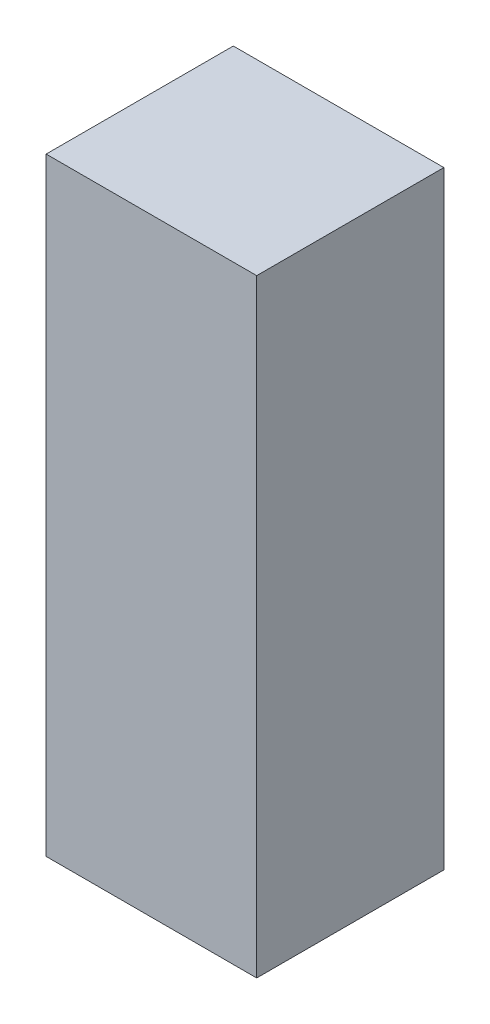
ISO-10303-21;
HEADER;
FILE_DESCRIPTION(('STEP AP214'),'2;1');
FILE_NAME('part.step','',(''),(''),'','','');
FILE_SCHEMA(('AUTOMOTIVE_DESIGN { 1 0 10303 214 1 1 1 1 }'));
ENDSEC;
DATA;
#1=APPLICATION_CONTEXT('core data for automotive mechanical design processes');
#2=APPLICATION_PROTOCOL_DEFINITION('international standard','automotive_design',2000,#1);
#3=PRODUCT_CONTEXT('',#1,'mechanical');
#4=PRODUCT('Part','Part','',(#3));
#5=PRODUCT_RELATED_PRODUCT_CATEGORY('part','',(#4));
#6=PRODUCT_DEFINITION_FORMATION('','',#4);
#7=PRODUCT_DEFINITION_CONTEXT('part definition',#1,'design');
#8=PRODUCT_DEFINITION('design','',#6,#7);
#9=PRODUCT_DEFINITION_SHAPE('','',#8);
#10=(LENGTH_UNIT() NAMED_UNIT(*) SI_UNIT(.MILLI.,.METRE.));
#11=(NAMED_UNIT(*) PLANE_ANGLE_UNIT() SI_UNIT($,.RADIAN.));
#12=(NAMED_UNIT(*) SI_UNIT($,.STERADIAN.) SOLID_ANGLE_UNIT());
#13=UNCERTAINTY_MEASURE_WITH_UNIT(LENGTH_MEASURE(1.E-05),#10,'distance_accuracy_value','');
#14=(GEOMETRIC_REPRESENTATION_CONTEXT(3) GLOBAL_UNCERTAINTY_ASSIGNED_CONTEXT((#13)) GLOBAL_UNIT_ASSIGNED_CONTEXT((#10,
#11,#12)) REPRESENTATION_CONTEXT('',''));
#15=CARTESIAN_POINT('',(0.,0.,0.));
#16=DIRECTION('',(0.,0.,1.));
#17=DIRECTION('',(1.,0.,0.));
#18=AXIS2_PLACEMENT_3D('',#15,#16,#17);
#19=CARTESIAN_POINT('',(0.22500082,0.65000124,0.4));
#20=DIRECTION('',(0.,0.,1.));
#21=DIRECTION('',(1.,0.,0.));
#22=AXIS2_PLACEMENT_3D('',#19,#20,#21);
#23=PLANE('',#22);
#24=DIRECTION('',(1.,0.,0.));
#25=VECTOR('',#24,1.);
#26=CARTESIAN_POINT('',(0.22500082,-0.6499987,0.4));
#27=LINE('',#26,#25);
#28=CARTESIAN_POINT('',(0.22500082,-0.6499987,0.4));
#29=VERTEX_POINT('',#28);
#30=CARTESIAN_POINT('',(-0.22499828,-0.6499987,0.4));
#31=VERTEX_POINT('',#30);
#32=EDGE_CURVE('E53',#29,#31,#27,.F.);
#33=ORIENTED_EDGE('',*,*,#32,.F.);
#34=DIRECTION('',(0.,1.,0.));
#35=VECTOR('',#34,1.);
#36=CARTESIAN_POINT('',(0.22500082,0.65000124,0.4));
#37=LINE('',#36,#35);
#38=CARTESIAN_POINT('',(0.22500082,0.65000124,0.4));
#39=VERTEX_POINT('',#38);
#40=EDGE_CURVE('E69',#39,#29,#37,.F.);
#41=ORIENTED_EDGE('',*,*,#40,.F.);
#42=DIRECTION('',(1.,0.,0.));
#43=VECTOR('',#42,1.);
#44=CARTESIAN_POINT('',(-0.22499828,0.65000124,0.4));
#45=LINE('',#44,#43);
#46=CARTESIAN_POINT('',(-0.22499828,0.65000124,0.4));
#47=VERTEX_POINT('',#46);
#48=EDGE_CURVE('E19',#47,#39,#45,.T.);
#49=ORIENTED_EDGE('',*,*,#48,.F.);
#50=DIRECTION('',(0.,1.,0.));
#51=VECTOR('',#50,1.);
#52=CARTESIAN_POINT('',(-0.22499828,-0.6499987,0.4));
#53=LINE('',#52,#51);
#54=EDGE_CURVE('E58',#31,#47,#53,.T.);
#55=ORIENTED_EDGE('',*,*,#54,.F.);
#56=EDGE_LOOP('',(#33,#41,#49,#55));
#57=FACE_BOUND('',#56,.T.);
#58=ADVANCED_FACE('F16',(#57),#23,.T.);
#59=CARTESIAN_POINT('',(-0.22499828,0.65000124,0.));
#60=DIRECTION('',(0.,1.,0.));
#61=DIRECTION('',(0.,0.,1.));
#62=AXIS2_PLACEMENT_3D('',#59,#60,#61);
#63=PLANE('',#62);
#64=DIRECTION('',(0.,0.,-1.));
#65=VECTOR('',#64,1.);
#66=CARTESIAN_POINT('',(0.22500082,0.65000124,0.));
#67=LINE('',#66,#65);
#68=CARTESIAN_POINT('',(0.22500082,0.65000124,0.));
#69=VERTEX_POINT('',#68);
#70=EDGE_CURVE('E88',#69,#39,#67,.F.);
#71=ORIENTED_EDGE('',*,*,#70,.F.);
#72=DIRECTION('',(1.,0.,0.));
#73=VECTOR('',#72,1.);
#74=CARTESIAN_POINT('',(0.22500082,0.65000124,0.));
#75=LINE('',#74,#73);
#76=CARTESIAN_POINT('',(-0.22499828,0.65000124,0.));
#77=VERTEX_POINT('',#76);
#78=EDGE_CURVE('E76',#69,#77,#75,.F.);
#79=ORIENTED_EDGE('',*,*,#78,.T.);
#80=DIRECTION('',(0.,0.,1.));
#81=VECTOR('',#80,1.);
#82=CARTESIAN_POINT('',(-0.22499828,0.65000124,0.));
#83=LINE('',#82,#81);
#84=EDGE_CURVE('E63',#47,#77,#83,.F.);
#85=ORIENTED_EDGE('',*,*,#84,.F.);
#86=ORIENTED_EDGE('',*,*,#48,.T.);
#87=EDGE_LOOP('',(#71,#79,#85,#86));
#88=FACE_BOUND('',#87,.T.);
#89=ADVANCED_FACE('F75',(#88),#63,.T.);
#90=CARTESIAN_POINT('',(-0.22499828,-0.6499987,0.));
#91=DIRECTION('',(-1.,0.,0.));
#92=DIRECTION('',(0.,0.,1.));
#93=AXIS2_PLACEMENT_3D('',#90,#91,#92);
#94=PLANE('',#93);
#95=ORIENTED_EDGE('',*,*,#84,.T.);
#96=DIRECTION('',(0.,1.,0.));
#97=VECTOR('',#96,1.);
#98=CARTESIAN_POINT('',(-0.22499828,0.65000124,0.));
#99=LINE('',#98,#97);
#100=CARTESIAN_POINT('',(-0.22499828,-0.6499987,0.));
#101=VERTEX_POINT('',#100);
#102=EDGE_CURVE('E96',#77,#101,#99,.F.);
#103=ORIENTED_EDGE('',*,*,#102,.T.);
#104=DIRECTION('',(0.,0.,-1.));
#105=VECTOR('',#104,1.);
#106=CARTESIAN_POINT('',(-0.22499828,-0.6499987,0.));
#107=LINE('',#106,#105);
#108=EDGE_CURVE('E65',#31,#101,#107,.T.);
#109=ORIENTED_EDGE('',*,*,#108,.F.);
#110=ORIENTED_EDGE('',*,*,#54,.T.);
#111=EDGE_LOOP('',(#95,#103,#109,#110));
#112=FACE_BOUND('',#111,.T.);
#113=ADVANCED_FACE('F60',(#112),#94,.T.);
#114=CARTESIAN_POINT('',(0.22500082,-0.6499987,0.));
#115=DIRECTION('',(0.,-1.,0.));
#116=DIRECTION('',(0.,0.,-1.));
#117=AXIS2_PLACEMENT_3D('',#114,#115,#116);
#118=PLANE('',#117);
#119=ORIENTED_EDGE('',*,*,#108,.T.);
#120=DIRECTION('',(1.,0.,0.));
#121=VECTOR('',#120,1.);
#122=CARTESIAN_POINT('',(0.22500082,-0.6499987,0.));
#123=LINE('',#122,#121);
#124=CARTESIAN_POINT('',(0.22500082,-0.6499987,0.));
#125=VERTEX_POINT('',#124);
#126=EDGE_CURVE('E26',#101,#125,#123,.T.);
#127=ORIENTED_EDGE('',*,*,#126,.T.);
#128=DIRECTION('',(0.,0.,-1.));
#129=VECTOR('',#128,1.);
#130=CARTESIAN_POINT('',(0.22500082,-0.6499987,0.));
#131=LINE('',#130,#129);
#132=EDGE_CURVE('E34',#29,#125,#131,.T.);
#133=ORIENTED_EDGE('',*,*,#132,.F.);
#134=ORIENTED_EDGE('',*,*,#32,.T.);
#135=EDGE_LOOP('',(#119,#127,#133,#134));
#136=FACE_BOUND('',#135,.T.);
#137=ADVANCED_FACE('F102',(#136),#118,.T.);
#138=CARTESIAN_POINT('',(0.22500082,0.65000124,0.));
#139=DIRECTION('',(1.,0.,0.));
#140=DIRECTION('',(0.,0.,-1.));
#141=AXIS2_PLACEMENT_3D('',#138,#139,#140);
#142=PLANE('',#141);
#143=ORIENTED_EDGE('',*,*,#132,.T.);
#144=DIRECTION('',(0.,1.,0.));
#145=VECTOR('',#144,1.);
#146=CARTESIAN_POINT('',(0.22500082,0.65000124,0.));
#147=LINE('',#146,#145);
#148=EDGE_CURVE('E11',#125,#69,#147,.T.);
#149=ORIENTED_EDGE('',*,*,#148,.T.);
#150=ORIENTED_EDGE('',*,*,#70,.T.);
#151=ORIENTED_EDGE('',*,*,#40,.T.);
#152=EDGE_LOOP('',(#143,#149,#150,#151));
#153=FACE_BOUND('',#152,.T.);
#154=ADVANCED_FACE('F105',(#153),#142,.T.);
#155=CARTESIAN_POINT('',(0.22500082,0.65000124,0.));
#156=DIRECTION('',(0.,0.,1.));
#157=DIRECTION('',(1.,0.,0.));
#158=AXIS2_PLACEMENT_3D('',#155,#156,#157);
#159=PLANE('',#158);
#160=ORIENTED_EDGE('',*,*,#126,.F.);
#161=ORIENTED_EDGE('',*,*,#102,.F.);
#162=ORIENTED_EDGE('',*,*,#78,.F.);
#163=ORIENTED_EDGE('',*,*,#148,.F.);
#164=EDGE_LOOP('',(#160,#161,#162,#163));
#165=FACE_BOUND('',#164,.T.);
#166=ADVANCED_FACE('F104',(#165),#159,.F.);
#167=CLOSED_SHELL('',(#58,#89,#113,#137,#154,#166));
#168=MANIFOLD_SOLID_BREP('B1',#167);
#169=ADVANCED_BREP_SHAPE_REPRESENTATION('',(#18,#168),#14);
#170=SHAPE_DEFINITION_REPRESENTATION(#9,#169);
ENDSEC;
END-ISO-10303-21;
